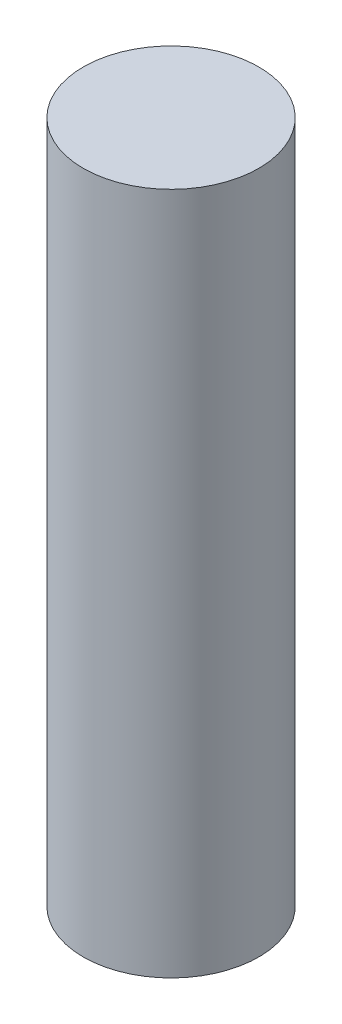
ISO-10303-21;
HEADER;
FILE_DESCRIPTION(('STEP AP214'),'2;1');
FILE_NAME('part.step','',(''),(''),'','','');
FILE_SCHEMA(('AUTOMOTIVE_DESIGN { 1 0 10303 214 1 1 1 1 }'));
ENDSEC;
DATA;
#1=APPLICATION_CONTEXT('core data for automotive mechanical design processes');
#2=APPLICATION_PROTOCOL_DEFINITION('international standard','automotive_design',2000,#1);
#3=PRODUCT_CONTEXT('',#1,'mechanical');
#4=PRODUCT('Part','Part','',(#3));
#5=PRODUCT_RELATED_PRODUCT_CATEGORY('part','',(#4));
#6=PRODUCT_DEFINITION_FORMATION('','',#4);
#7=PRODUCT_DEFINITION_CONTEXT('part definition',#1,'design');
#8=PRODUCT_DEFINITION('design','',#6,#7);
#9=PRODUCT_DEFINITION_SHAPE('','',#8);
#10=(LENGTH_UNIT() NAMED_UNIT(*) SI_UNIT(.MILLI.,.METRE.));
#11=(NAMED_UNIT(*) PLANE_ANGLE_UNIT() SI_UNIT($,.RADIAN.));
#12=(NAMED_UNIT(*) SI_UNIT($,.STERADIAN.) SOLID_ANGLE_UNIT());
#13=UNCERTAINTY_MEASURE_WITH_UNIT(LENGTH_MEASURE(1.E-05),#10,'distance_accuracy_value','');
#14=(GEOMETRIC_REPRESENTATION_CONTEXT(3) GLOBAL_UNCERTAINTY_ASSIGNED_CONTEXT((#13)) GLOBAL_UNIT_ASSIGNED_CONTEXT((#10,
#11,#12)) REPRESENTATION_CONTEXT('',''));
#15=CARTESIAN_POINT('',(0.,0.,0.));
#16=DIRECTION('',(0.,0.,1.));
#17=DIRECTION('',(1.,0.,0.));
#18=AXIS2_PLACEMENT_3D('',#15,#16,#17);
#19=CARTESIAN_POINT('',(0.,70.,0.));
#20=DIRECTION('',(0.,-1.,0.));
#21=DIRECTION('',(0.,0.,-1.));
#22=AXIS2_PLACEMENT_3D('',#19,#20,#21);
#23=CYLINDRICAL_SURFACE('',#22,9.);
#24=CARTESIAN_POINT('',(0.,70.,0.));
#25=DIRECTION('',(0.,1.,0.));
#26=DIRECTION('',(0.,0.,1.));
#27=AXIS2_PLACEMENT_3D('',#24,#25,#26);
#28=CIRCLE('',#27,9.);
#29=CARTESIAN_POINT('',(0.,70.,9.));
#30=VERTEX_POINT('',#29);
#31=EDGE_CURVE('E59',#30,#30,#28,.T.);
#32=ORIENTED_EDGE('',*,*,#31,.F.);
#33=EDGE_LOOP('',(#32));
#34=FACE_BOUND('',#33,.T.);
#35=CARTESIAN_POINT('',(0.,0.,0.));
#36=DIRECTION('',(0.,1.,0.));
#37=DIRECTION('',(0.,0.,1.));
#38=AXIS2_PLACEMENT_3D('',#35,#36,#37);
#39=CIRCLE('',#38,9.);
#40=CARTESIAN_POINT('',(0.,0.,9.));
#41=VERTEX_POINT('',#40);
#42=EDGE_CURVE('E63',#41,#41,#39,.T.);
#43=ORIENTED_EDGE('',*,*,#42,.T.);
#44=EDGE_LOOP('',(#43));
#45=FACE_BOUND('',#44,.T.);
#46=ADVANCED_FACE('F47',(#34,#45),#23,.T.);
#47=CARTESIAN_POINT('',(0.,70.,0.));
#48=DIRECTION('',(0.,1.,0.));
#49=DIRECTION('',(0.,0.,1.));
#50=AXIS2_PLACEMENT_3D('',#47,#48,#49);
#51=PLANE('',#50);
#52=ORIENTED_EDGE('',*,*,#31,.T.);
#53=EDGE_LOOP('',(#52));
#54=FACE_BOUND('',#53,.T.);
#55=ADVANCED_FACE('F93',(#54),#51,.T.);
#56=CARTESIAN_POINT('',(0.,0.,0.));
#57=DIRECTION('',(0.,1.,0.));
#58=DIRECTION('',(0.,0.,1.));
#59=AXIS2_PLACEMENT_3D('',#56,#57,#58);
#60=PLANE('',#59);
#61=CARTESIAN_POINT('',(0.,0.,0.));
#62=DIRECTION('',(0.,-1.,0.));
#63=DIRECTION('',(0.,0.,-1.));
#64=AXIS2_PLACEMENT_3D('',#61,#62,#63);
#65=CIRCLE('',#64,7.5);
#66=CARTESIAN_POINT('',(0.,0.,-7.5));
#67=VERTEX_POINT('',#66);
#68=EDGE_CURVE('E69',#67,#67,#65,.T.);
#69=ORIENTED_EDGE('',*,*,#68,.F.);
#70=EDGE_LOOP('',(#69));
#71=FACE_BOUND('',#70,.T.);
#72=ORIENTED_EDGE('',*,*,#42,.F.);
#73=EDGE_LOOP('',(#72));
#74=FACE_BOUND('',#73,.T.);
#75=ADVANCED_FACE('F98',(#71,#74),#60,.F.);
#76=CARTESIAN_POINT('',(0.,1.,0.));
#77=DIRECTION('',(0.,-1.,0.));
#78=DIRECTION('',(0.,0.,-1.));
#79=AXIS2_PLACEMENT_3D('',#76,#77,#78);
#80=CYLINDRICAL_SURFACE('',#79,7.5);
#81=CARTESIAN_POINT('',(0.,1.,0.));
#82=DIRECTION('',(0.,-1.,0.));
#83=DIRECTION('',(0.,0.,-1.));
#84=AXIS2_PLACEMENT_3D('',#81,#82,#83);
#85=CIRCLE('',#84,7.5);
#86=CARTESIAN_POINT('',(0.,1.,-7.5));
#87=VERTEX_POINT('',#86);
#88=EDGE_CURVE('E67',#87,#87,#85,.T.);
#89=ORIENTED_EDGE('',*,*,#88,.F.);
#90=EDGE_LOOP('',(#89));
#91=FACE_BOUND('',#90,.T.);
#92=ORIENTED_EDGE('',*,*,#68,.T.);
#93=EDGE_LOOP('',(#92));
#94=FACE_BOUND('',#93,.T.);
#95=ADVANCED_FACE('F90',(#91,#94),#80,.F.);
#96=CARTESIAN_POINT('',(0.,1.,0.));
#97=DIRECTION('',(0.,-1.,0.));
#98=DIRECTION('',(0.,0.,-1.));
#99=AXIS2_PLACEMENT_3D('',#96,#97,#98);
#100=PLANE('',#99);
#101=CARTESIAN_POINT('',(0.,1.,0.));
#102=DIRECTION('',(0.,-1.,0.));
#103=DIRECTION('',(0.,0.,-1.));
#104=AXIS2_PLACEMENT_3D('',#101,#102,#103);
#105=CIRCLE('',#104,2.50000000000002);
#106=CARTESIAN_POINT('',(0.,1.,-2.50000000000002));
#107=VERTEX_POINT('',#106);
#108=EDGE_CURVE('E10',#107,#107,#105,.F.);
#109=ORIENTED_EDGE('',*,*,#108,.T.);
#110=EDGE_LOOP('',(#109));
#111=FACE_BOUND('',#110,.T.);
#112=ORIENTED_EDGE('',*,*,#88,.T.);
#113=EDGE_LOOP('',(#112));
#114=FACE_BOUND('',#113,.T.);
#115=ADVANCED_FACE('F82',(#111,#114),#100,.T.);
#116=CARTESIAN_POINT('',(0.,51.,0.));
#117=DIRECTION('',(0.,-1.,0.));
#118=DIRECTION('',(0.,0.,-1.));
#119=AXIS2_PLACEMENT_3D('',#116,#117,#118);
#120=CYLINDRICAL_SURFACE('',#119,1.5);
#121=CARTESIAN_POINT('',(0.,2.73205080756891,0.));
#122=DIRECTION('',(0.,-1.,0.));
#123=DIRECTION('',(0.,0.,-1.));
#124=AXIS2_PLACEMENT_3D('',#121,#122,#123);
#125=CIRCLE('',#124,1.5);
#126=CARTESIAN_POINT('',(0.,2.73205080756891,-1.5));
#127=VERTEX_POINT('',#126);
#128=EDGE_CURVE('E55',#127,#127,#125,.T.);
#129=ORIENTED_EDGE('',*,*,#128,.T.);
#130=EDGE_LOOP('',(#129));
#131=FACE_BOUND('',#130,.T.);
#132=CARTESIAN_POINT('',(0.,51.,0.));
#133=DIRECTION('',(0.,-1.,0.));
#134=DIRECTION('',(0.,0.,-1.));
#135=AXIS2_PLACEMENT_3D('',#132,#133,#134);
#136=CIRCLE('',#135,1.5);
#137=CARTESIAN_POINT('',(0.,51.,-1.5));
#138=VERTEX_POINT('',#137);
#139=EDGE_CURVE('E72',#138,#138,#136,.T.);
#140=ORIENTED_EDGE('',*,*,#139,.F.);
#141=EDGE_LOOP('',(#140));
#142=FACE_BOUND('',#141,.T.);
#143=ADVANCED_FACE('F80',(#131,#142),#120,.F.);
#144=CARTESIAN_POINT('',(0.,51.,0.));
#145=DIRECTION('',(0.,-1.,0.));
#146=DIRECTION('',(0.,0.,-1.));
#147=AXIS2_PLACEMENT_3D('',#144,#145,#146);
#148=PLANE('',#147);
#149=ORIENTED_EDGE('',*,*,#139,.T.);
#150=EDGE_LOOP('',(#149));
#151=FACE_BOUND('',#150,.T.);
#152=ADVANCED_FACE('F78',(#151),#148,.T.);
#153=CARTESIAN_POINT('',(0.,2.73205080756891,0.));
#154=DIRECTION('',(0.,-1.,0.));
#155=DIRECTION('',(0.,0.,-1.));
#156=AXIS2_PLACEMENT_3D('',#153,#154,#155);
#157=CONICAL_SURFACE('',#156,1.5,0.523598775598298);
#158=ORIENTED_EDGE('',*,*,#108,.F.);
#159=EDGE_LOOP('',(#158));
#160=FACE_BOUND('',#159,.T.);
#161=ORIENTED_EDGE('',*,*,#128,.F.);
#162=EDGE_LOOP('',(#161));
#163=FACE_BOUND('',#162,.T.);
#164=ADVANCED_FACE('F50',(#160,#163),#157,.F.);
#165=CLOSED_SHELL('',(#46,#55,#75,#95,#115,#143,#152,#164));
#166=MANIFOLD_SOLID_BREP('B2',#165);
#167=ADVANCED_BREP_SHAPE_REPRESENTATION('',(#18,#166),#14);
#168=SHAPE_DEFINITION_REPRESENTATION(#9,#167);
ENDSEC;
END-ISO-10303-21;
